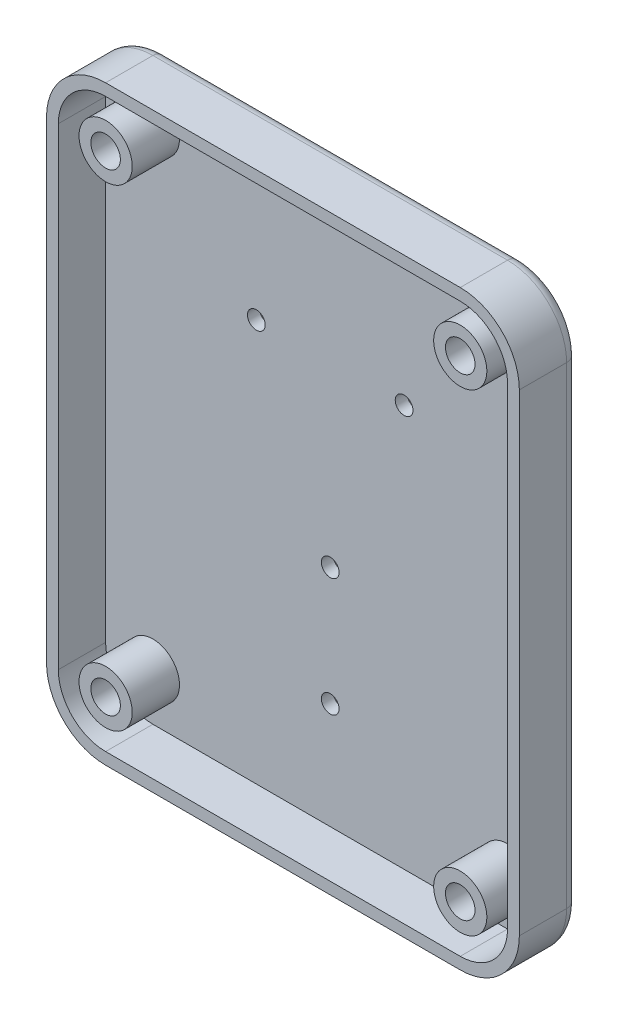
ISO-10303-21;
HEADER;
FILE_DESCRIPTION(('STEP AP214'),'2;1');
FILE_NAME('part.step','',(''),(''),'','','');
FILE_SCHEMA(('AUTOMOTIVE_DESIGN { 1 0 10303 214 1 1 1 1 }'));
ENDSEC;
DATA;
#1=APPLICATION_CONTEXT('core data for automotive mechanical design processes');
#2=APPLICATION_PROTOCOL_DEFINITION('international standard','automotive_design',2000,#1);
#3=PRODUCT_CONTEXT('',#1,'mechanical');
#4=PRODUCT('Part','Part','',(#3));
#5=PRODUCT_RELATED_PRODUCT_CATEGORY('part','',(#4));
#6=PRODUCT_DEFINITION_FORMATION('','',#4);
#7=PRODUCT_DEFINITION_CONTEXT('part definition',#1,'design');
#8=PRODUCT_DEFINITION('design','',#6,#7);
#9=PRODUCT_DEFINITION_SHAPE('','',#8);
#10=(LENGTH_UNIT() NAMED_UNIT(*) SI_UNIT(.MILLI.,.METRE.));
#11=(NAMED_UNIT(*) PLANE_ANGLE_UNIT() SI_UNIT($,.RADIAN.));
#12=(NAMED_UNIT(*) SI_UNIT($,.STERADIAN.) SOLID_ANGLE_UNIT());
#13=UNCERTAINTY_MEASURE_WITH_UNIT(LENGTH_MEASURE(1.E-05),#10,'distance_accuracy_value','');
#14=(GEOMETRIC_REPRESENTATION_CONTEXT(3) GLOBAL_UNCERTAINTY_ASSIGNED_CONTEXT((#13)) GLOBAL_UNIT_ASSIGNED_CONTEXT((#10,
#11,#12)) REPRESENTATION_CONTEXT('',''));
#15=CARTESIAN_POINT('',(0.,0.,0.));
#16=DIRECTION('',(0.,0.,1.));
#17=DIRECTION('',(1.,0.,0.));
#18=AXIS2_PLACEMENT_3D('',#15,#16,#17);
#19=CARTESIAN_POINT('',(0.,0.,10.));
#20=DIRECTION('',(0.,0.,-1.));
#21=DIRECTION('',(-1.,0.,0.));
#22=AXIS2_PLACEMENT_3D('',#19,#20,#21);
#23=PLANE('',#22);
#24=CARTESIAN_POINT('',(30.,40.,10.));
#25=DIRECTION('',(0.,0.,-1.));
#26=DIRECTION('',(-1.,0.,0.));
#27=AXIS2_PLACEMENT_3D('',#24,#25,#26);
#28=CIRCLE('',#27,4.5);
#29=CARTESIAN_POINT('',(25.5,40.,10.));
#30=VERTEX_POINT('',#29);
#31=EDGE_CURVE('E219',#30,#30,#28,.T.);
#32=ORIENTED_EDGE('',*,*,#31,.F.);
#33=EDGE_LOOP('',(#32));
#34=FACE_BOUND('',#33,.T.);
#35=CARTESIAN_POINT('',(30.,40.,10.));
#36=DIRECTION('',(0.,0.,-1.));
#37=DIRECTION('',(-1.,0.,0.));
#38=AXIS2_PLACEMENT_3D('',#35,#36,#37);
#39=CIRCLE('',#38,2.5);
#40=CARTESIAN_POINT('',(27.5,40.,10.));
#41=VERTEX_POINT('',#40);
#42=EDGE_CURVE('E275',#41,#41,#39,.T.);
#43=ORIENTED_EDGE('',*,*,#42,.T.);
#44=EDGE_LOOP('',(#43));
#45=FACE_BOUND('',#44,.T.);
#46=ADVANCED_FACE('F32',(#34,#45),#23,.F.);
#47=CARTESIAN_POINT('',(-30.,-40.,10.));
#48=DIRECTION('',(0.,0.,-1.));
#49=DIRECTION('',(-1.,0.,0.));
#50=AXIS2_PLACEMENT_3D('',#47,#48,#49);
#51=CIRCLE('',#50,4.5);
#52=CARTESIAN_POINT('',(-34.5,-40.,10.));
#53=VERTEX_POINT('',#52);
#54=EDGE_CURVE('E220',#53,#53,#51,.T.);
#55=ORIENTED_EDGE('',*,*,#54,.F.);
#56=EDGE_LOOP('',(#55));
#57=FACE_BOUND('',#56,.T.);
#58=CARTESIAN_POINT('',(-30.,-40.,10.));
#59=DIRECTION('',(0.,0.,-1.));
#60=DIRECTION('',(-1.,0.,0.));
#61=AXIS2_PLACEMENT_3D('',#58,#59,#60);
#62=CIRCLE('',#61,2.5);
#63=CARTESIAN_POINT('',(-32.5,-40.,10.));
#64=VERTEX_POINT('',#63);
#65=EDGE_CURVE('E282',#64,#64,#62,.T.);
#66=ORIENTED_EDGE('',*,*,#65,.T.);
#67=EDGE_LOOP('',(#66));
#68=FACE_BOUND('',#67,.T.);
#69=ADVANCED_FACE('F410',(#57,#68),#23,.F.);
#70=CARTESIAN_POINT('',(-30.,40.,10.));
#71=DIRECTION('',(0.,0.,-1.));
#72=DIRECTION('',(-1.,0.,0.));
#73=AXIS2_PLACEMENT_3D('',#70,#71,#72);
#74=CIRCLE('',#73,4.5);
#75=CARTESIAN_POINT('',(-34.5,40.,10.));
#76=VERTEX_POINT('',#75);
#77=EDGE_CURVE('E224',#76,#76,#74,.T.);
#78=ORIENTED_EDGE('',*,*,#77,.F.);
#79=EDGE_LOOP('',(#78));
#80=FACE_BOUND('',#79,.T.);
#81=CARTESIAN_POINT('',(-30.,40.,10.));
#82=DIRECTION('',(0.,0.,-1.));
#83=DIRECTION('',(-1.,0.,0.));
#84=AXIS2_PLACEMENT_3D('',#81,#82,#83);
#85=CIRCLE('',#84,2.5);
#86=CARTESIAN_POINT('',(-32.5,40.,10.));
#87=VERTEX_POINT('',#86);
#88=EDGE_CURVE('E267',#87,#87,#85,.T.);
#89=ORIENTED_EDGE('',*,*,#88,.T.);
#90=EDGE_LOOP('',(#89));
#91=FACE_BOUND('',#90,.T.);
#92=ADVANCED_FACE('F417',(#80,#91),#23,.F.);
#93=CARTESIAN_POINT('',(30.,-40.,10.));
#94=DIRECTION('',(0.,0.,-1.));
#95=DIRECTION('',(-1.,0.,0.));
#96=AXIS2_PLACEMENT_3D('',#93,#94,#95);
#97=CIRCLE('',#96,4.5);
#98=CARTESIAN_POINT('',(25.5,-40.,10.));
#99=VERTEX_POINT('',#98);
#100=EDGE_CURVE('E231',#99,#99,#97,.T.);
#101=ORIENTED_EDGE('',*,*,#100,.F.);
#102=EDGE_LOOP('',(#101));
#103=FACE_BOUND('',#102,.T.);
#104=CARTESIAN_POINT('',(30.,-40.,10.));
#105=DIRECTION('',(0.,0.,-1.));
#106=DIRECTION('',(-1.,0.,0.));
#107=AXIS2_PLACEMENT_3D('',#104,#105,#106);
#108=CIRCLE('',#107,2.5);
#109=CARTESIAN_POINT('',(27.5,-40.,10.));
#110=VERTEX_POINT('',#109);
#111=EDGE_CURVE('E287',#110,#110,#108,.T.);
#112=ORIENTED_EDGE('',*,*,#111,.T.);
#113=EDGE_LOOP('',(#112));
#114=FACE_BOUND('',#113,.T.);
#115=ADVANCED_FACE('F427',(#103,#114),#23,.F.);
#116=CARTESIAN_POINT('',(40.,-50.,10.));
#117=DIRECTION('',(-1.,0.,0.));
#118=DIRECTION('',(0.,0.,1.));
#119=AXIS2_PLACEMENT_3D('',#116,#117,#118);
#120=PLANE('',#119);
#121=DIRECTION('',(0.,0.,-1.));
#122=VECTOR('',#121,1.);
#123=CARTESIAN_POINT('',(40.,-40.,10.));
#124=LINE('',#123,#122);
#125=CARTESIAN_POINT('',(40.,-40.,10.));
#126=VERTEX_POINT('',#125);
#127=CARTESIAN_POINT('',(40.,-40.,2.));
#128=VERTEX_POINT('',#127);
#129=EDGE_CURVE('E306',#126,#128,#124,.T.);
#130=ORIENTED_EDGE('',*,*,#129,.T.);
#131=DIRECTION('',(0.,1.,0.));
#132=VECTOR('',#131,1.);
#133=CARTESIAN_POINT('',(40.,40.,2.));
#134=LINE('',#133,#132);
#135=CARTESIAN_POINT('',(40.,40.,2.));
#136=VERTEX_POINT('',#135);
#137=EDGE_CURVE('E359',#128,#136,#134,.T.);
#138=ORIENTED_EDGE('',*,*,#137,.T.);
#139=DIRECTION('',(0.,0.,-1.));
#140=VECTOR('',#139,1.);
#141=CARTESIAN_POINT('',(40.,40.,10.));
#142=LINE('',#141,#140);
#143=CARTESIAN_POINT('',(40.,40.,10.));
#144=VERTEX_POINT('',#143);
#145=EDGE_CURVE('E304',#136,#144,#142,.F.);
#146=ORIENTED_EDGE('',*,*,#145,.T.);
#147=DIRECTION('',(0.,1.,0.));
#148=VECTOR('',#147,1.);
#149=CARTESIAN_POINT('',(40.,-50.,10.));
#150=LINE('',#149,#148);
#151=EDGE_CURVE('E290',#126,#144,#150,.T.);
#152=ORIENTED_EDGE('',*,*,#151,.F.);
#153=EDGE_LOOP('',(#130,#138,#146,#152));
#154=FACE_BOUND('',#153,.T.);
#155=ADVANCED_FACE('F439',(#154),#120,.F.);
#156=CARTESIAN_POINT('',(-40.,50.,10.));
#157=DIRECTION('',(0.,-1.,0.));
#158=DIRECTION('',(0.,0.,-1.));
#159=AXIS2_PLACEMENT_3D('',#156,#157,#158);
#160=PLANE('',#159);
#161=DIRECTION('',(0.,0.,-1.));
#162=VECTOR('',#161,1.);
#163=CARTESIAN_POINT('',(30.,50.,10.));
#164=LINE('',#163,#162);
#165=CARTESIAN_POINT('',(30.,50.,10.));
#166=VERTEX_POINT('',#165);
#167=CARTESIAN_POINT('',(30.,50.,2.));
#168=VERTEX_POINT('',#167);
#169=EDGE_CURVE('E326',#166,#168,#164,.T.);
#170=ORIENTED_EDGE('',*,*,#169,.T.);
#171=DIRECTION('',(-1.,0.,0.));
#172=VECTOR('',#171,1.);
#173=CARTESIAN_POINT('',(-30.,50.,2.));
#174=LINE('',#173,#172);
#175=CARTESIAN_POINT('',(-30.,50.,2.));
#176=VERTEX_POINT('',#175);
#177=EDGE_CURVE('E355',#168,#176,#174,.T.);
#178=ORIENTED_EDGE('',*,*,#177,.T.);
#179=DIRECTION('',(0.,0.,-1.));
#180=VECTOR('',#179,1.);
#181=CARTESIAN_POINT('',(-30.,50.,10.));
#182=LINE('',#181,#180);
#183=CARTESIAN_POINT('',(-30.,50.,10.));
#184=VERTEX_POINT('',#183);
#185=EDGE_CURVE('E329',#176,#184,#182,.F.);
#186=ORIENTED_EDGE('',*,*,#185,.T.);
#187=DIRECTION('',(-1.,0.,0.));
#188=VECTOR('',#187,1.);
#189=CARTESIAN_POINT('',(-40.,50.,10.));
#190=LINE('',#189,#188);
#191=EDGE_CURVE('E295',#166,#184,#190,.T.);
#192=ORIENTED_EDGE('',*,*,#191,.F.);
#193=EDGE_LOOP('',(#170,#178,#186,#192));
#194=FACE_BOUND('',#193,.T.);
#195=ADVANCED_FACE('F445',(#194),#160,.F.);
#196=CARTESIAN_POINT('',(-40.,-50.,10.));
#197=DIRECTION('',(1.,0.,0.));
#198=DIRECTION('',(0.,0.,-1.));
#199=AXIS2_PLACEMENT_3D('',#196,#197,#198);
#200=PLANE('',#199);
#201=DIRECTION('',(0.,0.,-1.));
#202=VECTOR('',#201,1.);
#203=CARTESIAN_POINT('',(-40.,40.,10.));
#204=LINE('',#203,#202);
#205=CARTESIAN_POINT('',(-40.,40.,10.));
#206=VERTEX_POINT('',#205);
#207=CARTESIAN_POINT('',(-40.,40.,2.));
#208=VERTEX_POINT('',#207);
#209=EDGE_CURVE('E321',#206,#208,#204,.T.);
#210=ORIENTED_EDGE('',*,*,#209,.T.);
#211=DIRECTION('',(0.,-1.,0.));
#212=VECTOR('',#211,1.);
#213=CARTESIAN_POINT('',(-40.,-40.,2.));
#214=LINE('',#213,#212);
#215=CARTESIAN_POINT('',(-40.,-40.,2.));
#216=VERTEX_POINT('',#215);
#217=EDGE_CURVE('E351',#208,#216,#214,.T.);
#218=ORIENTED_EDGE('',*,*,#217,.T.);
#219=DIRECTION('',(0.,0.,-1.));
#220=VECTOR('',#219,1.);
#221=CARTESIAN_POINT('',(-40.,-40.,10.));
#222=LINE('',#221,#220);
#223=CARTESIAN_POINT('',(-40.,-40.,10.));
#224=VERTEX_POINT('',#223);
#225=EDGE_CURVE('E324',#216,#224,#222,.F.);
#226=ORIENTED_EDGE('',*,*,#225,.T.);
#227=DIRECTION('',(0.,-1.,0.));
#228=VECTOR('',#227,1.);
#229=CARTESIAN_POINT('',(-40.,-50.,10.));
#230=LINE('',#229,#228);
#231=EDGE_CURVE('E298',#206,#224,#230,.T.);
#232=ORIENTED_EDGE('',*,*,#231,.F.);
#233=EDGE_LOOP('',(#210,#218,#226,#232));
#234=FACE_BOUND('',#233,.T.);
#235=ADVANCED_FACE('F434',(#234),#200,.F.);
#236=CARTESIAN_POINT('',(-40.,-50.,10.));
#237=DIRECTION('',(0.,1.,0.));
#238=DIRECTION('',(0.,0.,1.));
#239=AXIS2_PLACEMENT_3D('',#236,#237,#238);
#240=PLANE('',#239);
#241=DIRECTION('',(0.,0.,-1.));
#242=VECTOR('',#241,1.);
#243=CARTESIAN_POINT('',(-30.,-50.,10.));
#244=LINE('',#243,#242);
#245=CARTESIAN_POINT('',(-30.,-50.,10.));
#246=VERTEX_POINT('',#245);
#247=CARTESIAN_POINT('',(-30.,-50.,2.));
#248=VERTEX_POINT('',#247);
#249=EDGE_CURVE('E309',#246,#248,#244,.T.);
#250=ORIENTED_EDGE('',*,*,#249,.T.);
#251=DIRECTION('',(1.,0.,0.));
#252=VECTOR('',#251,1.);
#253=CARTESIAN_POINT('',(30.,-50.,2.));
#254=LINE('',#253,#252);
#255=CARTESIAN_POINT('',(30.,-50.,2.));
#256=VERTEX_POINT('',#255);
#257=EDGE_CURVE('E11',#248,#256,#254,.T.);
#258=ORIENTED_EDGE('',*,*,#257,.T.);
#259=DIRECTION('',(0.,0.,-1.));
#260=VECTOR('',#259,1.);
#261=CARTESIAN_POINT('',(30.,-50.,10.));
#262=LINE('',#261,#260);
#263=CARTESIAN_POINT('',(30.,-50.,10.));
#264=VERTEX_POINT('',#263);
#265=EDGE_CURVE('E311',#256,#264,#262,.F.);
#266=ORIENTED_EDGE('',*,*,#265,.T.);
#267=DIRECTION('',(1.,0.,0.));
#268=VECTOR('',#267,1.);
#269=CARTESIAN_POINT('',(-40.,-50.,10.));
#270=LINE('',#269,#268);
#271=EDGE_CURVE('E301',#246,#264,#270,.T.);
#272=ORIENTED_EDGE('',*,*,#271,.F.);
#273=EDGE_LOOP('',(#250,#258,#266,#272));
#274=FACE_BOUND('',#273,.T.);
#275=ADVANCED_FACE('F425',(#274),#240,.F.);
#276=DIRECTION('',(1.,0.,0.));
#277=VECTOR('',#276,1.);
#278=CARTESIAN_POINT('',(0.,-48.,10.));
#279=LINE('',#278,#277);
#280=CARTESIAN_POINT('',(-30.,-48.,10.));
#281=VERTEX_POINT('',#280);
#282=CARTESIAN_POINT('',(30.,-48.,10.));
#283=VERTEX_POINT('',#282);
#284=EDGE_CURVE('E205',#281,#283,#279,.T.);
#285=ORIENTED_EDGE('',*,*,#284,.F.);
#286=CARTESIAN_POINT('',(-30.,-40.,10.));
#287=DIRECTION('',(0.,0.,-1.));
#288=DIRECTION('',(-1.,0.,0.));
#289=AXIS2_PLACEMENT_3D('',#286,#287,#288);
#290=CIRCLE('',#289,8.);
#291=CARTESIAN_POINT('',(-38.,-40.,10.));
#292=VERTEX_POINT('',#291);
#293=EDGE_CURVE('E253',#292,#281,#290,.F.);
#294=ORIENTED_EDGE('',*,*,#293,.F.);
#295=DIRECTION('',(0.,-1.,0.));
#296=VECTOR('',#295,1.);
#297=CARTESIAN_POINT('',(-38.,0.,10.));
#298=LINE('',#297,#296);
#299=CARTESIAN_POINT('',(-38.,40.,10.));
#300=VERTEX_POINT('',#299);
#301=EDGE_CURVE('E49',#300,#292,#298,.T.);
#302=ORIENTED_EDGE('',*,*,#301,.F.);
#303=CARTESIAN_POINT('',(-30.,40.,10.));
#304=DIRECTION('',(0.,0.,-1.));
#305=DIRECTION('',(-1.,0.,0.));
#306=AXIS2_PLACEMENT_3D('',#303,#304,#305);
#307=CIRCLE('',#306,8.);
#308=CARTESIAN_POINT('',(-30.,48.,10.));
#309=VERTEX_POINT('',#308);
#310=EDGE_CURVE('E249',#309,#300,#307,.F.);
#311=ORIENTED_EDGE('',*,*,#310,.F.);
#312=DIRECTION('',(-1.,0.,0.));
#313=VECTOR('',#312,1.);
#314=CARTESIAN_POINT('',(0.,48.,10.));
#315=LINE('',#314,#313);
#316=CARTESIAN_POINT('',(30.,48.,10.));
#317=VERTEX_POINT('',#316);
#318=EDGE_CURVE('E247',#317,#309,#315,.T.);
#319=ORIENTED_EDGE('',*,*,#318,.F.);
#320=CARTESIAN_POINT('',(30.,40.,10.));
#321=DIRECTION('',(0.,0.,-1.));
#322=DIRECTION('',(-1.,0.,0.));
#323=AXIS2_PLACEMENT_3D('',#320,#321,#322);
#324=CIRCLE('',#323,8.);
#325=CARTESIAN_POINT('',(38.,40.,10.));
#326=VERTEX_POINT('',#325);
#327=EDGE_CURVE('E244',#326,#317,#324,.F.);
#328=ORIENTED_EDGE('',*,*,#327,.F.);
#329=DIRECTION('',(0.,1.,0.));
#330=VECTOR('',#329,1.);
#331=CARTESIAN_POINT('',(38.,0.,10.));
#332=LINE('',#331,#330);
#333=CARTESIAN_POINT('',(38.,-40.,10.));
#334=VERTEX_POINT('',#333);
#335=EDGE_CURVE('E245',#334,#326,#332,.T.);
#336=ORIENTED_EDGE('',*,*,#335,.F.);
#337=CARTESIAN_POINT('',(30.,-40.,10.));
#338=DIRECTION('',(0.,0.,-1.));
#339=DIRECTION('',(-1.,0.,0.));
#340=AXIS2_PLACEMENT_3D('',#337,#338,#339);
#341=CIRCLE('',#340,8.);
#342=EDGE_CURVE('E177',#283,#334,#341,.F.);
#343=ORIENTED_EDGE('',*,*,#342,.F.);
#344=EDGE_LOOP('',(#285,#294,#302,#311,#319,#328,#336,#343));
#345=FACE_BOUND('',#344,.T.);
#346=ORIENTED_EDGE('',*,*,#271,.T.);
#347=CARTESIAN_POINT('',(30.,-40.,10.));
#348=DIRECTION('',(0.,0.,-1.));
#349=DIRECTION('',(-1.,0.,0.));
#350=AXIS2_PLACEMENT_3D('',#347,#348,#349);
#351=CIRCLE('',#350,10.);
#352=EDGE_CURVE('E319',#264,#126,#351,.F.);
#353=ORIENTED_EDGE('',*,*,#352,.T.);
#354=ORIENTED_EDGE('',*,*,#151,.T.);
#355=CARTESIAN_POINT('',(30.,40.,10.));
#356=DIRECTION('',(0.,0.,-1.));
#357=DIRECTION('',(-1.,0.,0.));
#358=AXIS2_PLACEMENT_3D('',#355,#356,#357);
#359=CIRCLE('',#358,10.);
#360=EDGE_CURVE('E313',#144,#166,#359,.F.);
#361=ORIENTED_EDGE('',*,*,#360,.T.);
#362=ORIENTED_EDGE('',*,*,#191,.T.);
#363=CARTESIAN_POINT('',(-30.,40.,10.));
#364=DIRECTION('',(0.,0.,-1.));
#365=DIRECTION('',(-1.,0.,0.));
#366=AXIS2_PLACEMENT_3D('',#363,#364,#365);
#367=CIRCLE('',#366,10.);
#368=EDGE_CURVE('E315',#184,#206,#367,.F.);
#369=ORIENTED_EDGE('',*,*,#368,.T.);
#370=ORIENTED_EDGE('',*,*,#231,.T.);
#371=CARTESIAN_POINT('',(-30.,-40.,10.));
#372=DIRECTION('',(0.,0.,-1.));
#373=DIRECTION('',(-1.,0.,0.));
#374=AXIS2_PLACEMENT_3D('',#371,#372,#373);
#375=CIRCLE('',#374,10.);
#376=EDGE_CURVE('E317',#224,#246,#375,.F.);
#377=ORIENTED_EDGE('',*,*,#376,.T.);
#378=EDGE_LOOP('',(#346,#353,#354,#361,#362,#369,#370,#377));
#379=FACE_BOUND('',#378,.T.);
#380=ADVANCED_FACE('F413',(#345,#379),#23,.F.);
#381=CARTESIAN_POINT('',(0.,0.,0.));
#382=DIRECTION('',(0.,0.,-1.));
#383=DIRECTION('',(-1.,0.,0.));
#384=AXIS2_PLACEMENT_3D('',#381,#382,#383);
#385=PLANE('',#384);
#386=CARTESIAN_POINT('',(-12.5,20.,0.));
#387=DIRECTION('',(0.,0.,-1.));
#388=DIRECTION('',(-1.,0.,0.));
#389=AXIS2_PLACEMENT_3D('',#386,#387,#388);
#390=CIRCLE('',#389,1.5);
#391=CARTESIAN_POINT('',(-14.,20.,0.));
#392=VERTEX_POINT('',#391);
#393=EDGE_CURVE('E542',#392,#392,#390,.T.);
#394=ORIENTED_EDGE('',*,*,#393,.F.);
#395=EDGE_LOOP('',(#394));
#396=FACE_BOUND('',#395,.T.);
#397=CARTESIAN_POINT('',(12.5,20.,0.));
#398=DIRECTION('',(0.,0.,-1.));
#399=DIRECTION('',(-1.,0.,0.));
#400=AXIS2_PLACEMENT_3D('',#397,#398,#399);
#401=CIRCLE('',#400,1.5);
#402=CARTESIAN_POINT('',(11.,20.,0.));
#403=VERTEX_POINT('',#402);
#404=EDGE_CURVE('E539',#403,#403,#401,.T.);
#405=ORIENTED_EDGE('',*,*,#404,.F.);
#406=EDGE_LOOP('',(#405));
#407=FACE_BOUND('',#406,.T.);
#408=CARTESIAN_POINT('',(0.,-30.,0.));
#409=DIRECTION('',(0.,0.,-1.));
#410=DIRECTION('',(-1.,0.,0.));
#411=AXIS2_PLACEMENT_3D('',#408,#409,#410);
#412=CIRCLE('',#411,1.5);
#413=CARTESIAN_POINT('',(-1.5,-30.,0.));
#414=VERTEX_POINT('',#413);
#415=EDGE_CURVE('E537',#414,#414,#412,.T.);
#416=ORIENTED_EDGE('',*,*,#415,.F.);
#417=EDGE_LOOP('',(#416));
#418=FACE_BOUND('',#417,.T.);
#419=CARTESIAN_POINT('',(0.,-10.,0.));
#420=DIRECTION('',(0.,0.,-1.));
#421=DIRECTION('',(-1.,0.,0.));
#422=AXIS2_PLACEMENT_3D('',#419,#420,#421);
#423=CIRCLE('',#422,1.5);
#424=CARTESIAN_POINT('',(-1.5,-10.,0.));
#425=VERTEX_POINT('',#424);
#426=EDGE_CURVE('E386',#425,#425,#423,.T.);
#427=ORIENTED_EDGE('',*,*,#426,.F.);
#428=EDGE_LOOP('',(#427));
#429=FACE_BOUND('',#428,.T.);
#430=DIRECTION('',(1.,0.,0.));
#431=VECTOR('',#430,1.);
#432=CARTESIAN_POINT('',(-30.,-48.,0.));
#433=LINE('',#432,#431);
#434=CARTESIAN_POINT('',(30.,-48.,0.));
#435=VERTEX_POINT('',#434);
#436=CARTESIAN_POINT('',(-30.,-48.,0.));
#437=VERTEX_POINT('',#436);
#438=EDGE_CURVE('E331',#435,#437,#433,.F.);
#439=ORIENTED_EDGE('',*,*,#438,.T.);
#440=CARTESIAN_POINT('',(-30.,-40.,0.));
#441=DIRECTION('',(0.,0.,-1.));
#442=DIRECTION('',(-1.,0.,0.));
#443=AXIS2_PLACEMENT_3D('',#440,#441,#442);
#444=CIRCLE('',#443,8.);
#445=CARTESIAN_POINT('',(-38.,-40.,0.));
#446=VERTEX_POINT('',#445);
#447=EDGE_CURVE('E345',#437,#446,#444,.T.);
#448=ORIENTED_EDGE('',*,*,#447,.T.);
#449=DIRECTION('',(0.,-1.,0.));
#450=VECTOR('',#449,1.);
#451=CARTESIAN_POINT('',(-38.,40.,0.));
#452=LINE('',#451,#450);
#453=CARTESIAN_POINT('',(-38.,40.,0.));
#454=VERTEX_POINT('',#453);
#455=EDGE_CURVE('E343',#446,#454,#452,.F.);
#456=ORIENTED_EDGE('',*,*,#455,.T.);
#457=CARTESIAN_POINT('',(-30.,40.,0.));
#458=DIRECTION('',(0.,0.,-1.));
#459=DIRECTION('',(-1.,0.,0.));
#460=AXIS2_PLACEMENT_3D('',#457,#458,#459);
#461=CIRCLE('',#460,8.);
#462=CARTESIAN_POINT('',(-30.,48.,0.));
#463=VERTEX_POINT('',#462);
#464=EDGE_CURVE('E341',#454,#463,#461,.T.);
#465=ORIENTED_EDGE('',*,*,#464,.T.);
#466=DIRECTION('',(-1.,0.,0.));
#467=VECTOR('',#466,1.);
#468=CARTESIAN_POINT('',(30.,48.,0.));
#469=LINE('',#468,#467);
#470=CARTESIAN_POINT('',(30.,48.,0.));
#471=VERTEX_POINT('',#470);
#472=EDGE_CURVE('E339',#463,#471,#469,.F.);
#473=ORIENTED_EDGE('',*,*,#472,.T.);
#474=CARTESIAN_POINT('',(30.,40.,0.));
#475=DIRECTION('',(0.,0.,-1.));
#476=DIRECTION('',(-1.,0.,0.));
#477=AXIS2_PLACEMENT_3D('',#474,#475,#476);
#478=CIRCLE('',#477,8.);
#479=CARTESIAN_POINT('',(38.,40.,0.));
#480=VERTEX_POINT('',#479);
#481=EDGE_CURVE('E337',#471,#480,#478,.T.);
#482=ORIENTED_EDGE('',*,*,#481,.T.);
#483=DIRECTION('',(0.,1.,0.));
#484=VECTOR('',#483,1.);
#485=CARTESIAN_POINT('',(38.,-40.,0.));
#486=LINE('',#485,#484);
#487=CARTESIAN_POINT('',(38.,-40.,0.));
#488=VERTEX_POINT('',#487);
#489=EDGE_CURVE('E335',#480,#488,#486,.F.);
#490=ORIENTED_EDGE('',*,*,#489,.T.);
#491=CARTESIAN_POINT('',(30.,-40.,0.));
#492=DIRECTION('',(0.,0.,-1.));
#493=DIRECTION('',(-1.,0.,0.));
#494=AXIS2_PLACEMENT_3D('',#491,#492,#493);
#495=CIRCLE('',#494,8.);
#496=EDGE_CURVE('E333',#488,#435,#495,.T.);
#497=ORIENTED_EDGE('',*,*,#496,.T.);
#498=EDGE_LOOP('',(#439,#448,#456,#465,#473,#482,#490,#497));
#499=FACE_BOUND('',#498,.T.);
#500=CARTESIAN_POINT('',(30.,40.,0.));
#501=DIRECTION('',(0.,0.,-1.));
#502=DIRECTION('',(-1.,0.,0.));
#503=AXIS2_PLACEMENT_3D('',#500,#501,#502);
#504=CIRCLE('',#503,2.5);
#505=CARTESIAN_POINT('',(27.5,40.,0.));
#506=VERTEX_POINT('',#505);
#507=EDGE_CURVE('E279',#506,#506,#504,.T.);
#508=ORIENTED_EDGE('',*,*,#507,.F.);
#509=EDGE_LOOP('',(#508));
#510=FACE_BOUND('',#509,.T.);
#511=CARTESIAN_POINT('',(-30.,-40.,0.));
#512=DIRECTION('',(0.,0.,-1.));
#513=DIRECTION('',(-1.,0.,0.));
#514=AXIS2_PLACEMENT_3D('',#511,#512,#513);
#515=CIRCLE('',#514,2.5);
#516=CARTESIAN_POINT('',(-32.5,-40.,0.));
#517=VERTEX_POINT('',#516);
#518=EDGE_CURVE('E270',#517,#517,#515,.T.);
#519=ORIENTED_EDGE('',*,*,#518,.F.);
#520=EDGE_LOOP('',(#519));
#521=FACE_BOUND('',#520,.T.);
#522=CARTESIAN_POINT('',(-30.,40.,0.));
#523=DIRECTION('',(0.,0.,-1.));
#524=DIRECTION('',(-1.,0.,0.));
#525=AXIS2_PLACEMENT_3D('',#522,#523,#524);
#526=CIRCLE('',#525,2.5);
#527=CARTESIAN_POINT('',(-32.5,40.,0.));
#528=VERTEX_POINT('',#527);
#529=EDGE_CURVE('E271',#528,#528,#526,.T.);
#530=ORIENTED_EDGE('',*,*,#529,.F.);
#531=EDGE_LOOP('',(#530));
#532=FACE_BOUND('',#531,.T.);
#533=CARTESIAN_POINT('',(30.,-40.,0.));
#534=DIRECTION('',(0.,0.,-1.));
#535=DIRECTION('',(-1.,0.,0.));
#536=AXIS2_PLACEMENT_3D('',#533,#534,#535);
#537=CIRCLE('',#536,2.5);
#538=CARTESIAN_POINT('',(27.5,-40.,0.));
#539=VERTEX_POINT('',#538);
#540=EDGE_CURVE('E278',#539,#539,#537,.T.);
#541=ORIENTED_EDGE('',*,*,#540,.F.);
#542=EDGE_LOOP('',(#541));
#543=FACE_BOUND('',#542,.T.);
#544=ADVANCED_FACE('F424',(#396,#407,#418,#429,#499,#510,#521,#532,#543),#385,.T.);
#545=CARTESIAN_POINT('',(30.,-40.,10.));
#546=DIRECTION('',(0.,0.,-1.));
#547=DIRECTION('',(-1.,0.,0.));
#548=AXIS2_PLACEMENT_3D('',#545,#546,#547);
#549=CYLINDRICAL_SURFACE('',#548,10.);
#550=ORIENTED_EDGE('',*,*,#265,.F.);
#551=CARTESIAN_POINT('',(30.,-40.,2.));
#552=DIRECTION('',(0.,0.,-1.));
#553=DIRECTION('',(-1.,0.,0.));
#554=AXIS2_PLACEMENT_3D('',#551,#552,#553);
#555=CIRCLE('',#554,10.);
#556=EDGE_CURVE('E41',#256,#128,#555,.F.);
#557=ORIENTED_EDGE('',*,*,#556,.T.);
#558=ORIENTED_EDGE('',*,*,#129,.F.);
#559=ORIENTED_EDGE('',*,*,#352,.F.);
#560=EDGE_LOOP('',(#550,#557,#558,#559));
#561=FACE_BOUND('',#560,.T.);
#562=ADVANCED_FACE('F432',(#561),#549,.T.);
#563=CARTESIAN_POINT('',(-30.,-40.,10.));
#564=DIRECTION('',(0.,0.,-1.));
#565=DIRECTION('',(-1.,0.,0.));
#566=AXIS2_PLACEMENT_3D('',#563,#564,#565);
#567=CYLINDRICAL_SURFACE('',#566,10.);
#568=ORIENTED_EDGE('',*,*,#225,.F.);
#569=CARTESIAN_POINT('',(-30.,-40.,2.));
#570=DIRECTION('',(0.,0.,-1.));
#571=DIRECTION('',(-1.,0.,0.));
#572=AXIS2_PLACEMENT_3D('',#569,#570,#571);
#573=CIRCLE('',#572,10.);
#574=EDGE_CURVE('E348',#216,#248,#573,.F.);
#575=ORIENTED_EDGE('',*,*,#574,.T.);
#576=ORIENTED_EDGE('',*,*,#249,.F.);
#577=ORIENTED_EDGE('',*,*,#376,.F.);
#578=EDGE_LOOP('',(#568,#575,#576,#577));
#579=FACE_BOUND('',#578,.T.);
#580=ADVANCED_FACE('F617',(#579),#567,.T.);
#581=CARTESIAN_POINT('',(-30.,40.,10.));
#582=DIRECTION('',(0.,0.,-1.));
#583=DIRECTION('',(-1.,0.,0.));
#584=AXIS2_PLACEMENT_3D('',#581,#582,#583);
#585=CYLINDRICAL_SURFACE('',#584,10.);
#586=ORIENTED_EDGE('',*,*,#185,.F.);
#587=CARTESIAN_POINT('',(-30.,40.,2.));
#588=DIRECTION('',(0.,0.,-1.));
#589=DIRECTION('',(-1.,0.,0.));
#590=AXIS2_PLACEMENT_3D('',#587,#588,#589);
#591=CIRCLE('',#590,10.);
#592=EDGE_CURVE('E353',#176,#208,#591,.F.);
#593=ORIENTED_EDGE('',*,*,#592,.T.);
#594=ORIENTED_EDGE('',*,*,#209,.F.);
#595=ORIENTED_EDGE('',*,*,#368,.F.);
#596=EDGE_LOOP('',(#586,#593,#594,#595));
#597=FACE_BOUND('',#596,.T.);
#598=ADVANCED_FACE('F467',(#597),#585,.T.);
#599=CARTESIAN_POINT('',(30.,40.,10.));
#600=DIRECTION('',(0.,0.,-1.));
#601=DIRECTION('',(-1.,0.,0.));
#602=AXIS2_PLACEMENT_3D('',#599,#600,#601);
#603=CYLINDRICAL_SURFACE('',#602,10.);
#604=ORIENTED_EDGE('',*,*,#145,.F.);
#605=CARTESIAN_POINT('',(30.,40.,2.));
#606=DIRECTION('',(0.,0.,-1.));
#607=DIRECTION('',(-1.,0.,0.));
#608=AXIS2_PLACEMENT_3D('',#605,#606,#607);
#609=CIRCLE('',#608,10.);
#610=EDGE_CURVE('E357',#136,#168,#609,.F.);
#611=ORIENTED_EDGE('',*,*,#610,.T.);
#612=ORIENTED_EDGE('',*,*,#169,.F.);
#613=ORIENTED_EDGE('',*,*,#360,.F.);
#614=EDGE_LOOP('',(#604,#611,#612,#613));
#615=FACE_BOUND('',#614,.T.);
#616=ADVANCED_FACE('F457',(#615),#603,.T.);
#617=CARTESIAN_POINT('',(30.,-40.,10.));
#618=DIRECTION('',(0.,0.,-1.));
#619=DIRECTION('',(-1.,0.,0.));
#620=AXIS2_PLACEMENT_3D('',#617,#618,#619);
#621=CYLINDRICAL_SURFACE('',#620,2.5);
#622=ORIENTED_EDGE('',*,*,#111,.F.);
#623=EDGE_LOOP('',(#622));
#624=FACE_BOUND('',#623,.T.);
#625=ORIENTED_EDGE('',*,*,#540,.T.);
#626=EDGE_LOOP('',(#625));
#627=FACE_BOUND('',#626,.T.);
#628=ADVANCED_FACE('F453',(#624,#627),#621,.F.);
#629=CARTESIAN_POINT('',(-30.,40.,10.));
#630=DIRECTION('',(0.,0.,-1.));
#631=DIRECTION('',(-1.,0.,0.));
#632=AXIS2_PLACEMENT_3D('',#629,#630,#631);
#633=CYLINDRICAL_SURFACE('',#632,2.5);
#634=ORIENTED_EDGE('',*,*,#88,.F.);
#635=EDGE_LOOP('',(#634));
#636=FACE_BOUND('',#635,.T.);
#637=ORIENTED_EDGE('',*,*,#529,.T.);
#638=EDGE_LOOP('',(#637));
#639=FACE_BOUND('',#638,.T.);
#640=ADVANCED_FACE('F456',(#636,#639),#633,.F.);
#641=CARTESIAN_POINT('',(-30.,-40.,10.));
#642=DIRECTION('',(0.,0.,-1.));
#643=DIRECTION('',(-1.,0.,0.));
#644=AXIS2_PLACEMENT_3D('',#641,#642,#643);
#645=CYLINDRICAL_SURFACE('',#644,2.5);
#646=ORIENTED_EDGE('',*,*,#65,.F.);
#647=EDGE_LOOP('',(#646));
#648=FACE_BOUND('',#647,.T.);
#649=ORIENTED_EDGE('',*,*,#518,.T.);
#650=EDGE_LOOP('',(#649));
#651=FACE_BOUND('',#650,.T.);
#652=ADVANCED_FACE('F464',(#648,#651),#645,.F.);
#653=CARTESIAN_POINT('',(30.,40.,10.));
#654=DIRECTION('',(0.,0.,-1.));
#655=DIRECTION('',(-1.,0.,0.));
#656=AXIS2_PLACEMENT_3D('',#653,#654,#655);
#657=CYLINDRICAL_SURFACE('',#656,2.5);
#658=ORIENTED_EDGE('',*,*,#42,.F.);
#659=EDGE_LOOP('',(#658));
#660=FACE_BOUND('',#659,.T.);
#661=ORIENTED_EDGE('',*,*,#507,.T.);
#662=EDGE_LOOP('',(#661));
#663=FACE_BOUND('',#662,.T.);
#664=ADVANCED_FACE('F473',(#660,#663),#657,.F.);
#665=CARTESIAN_POINT('',(30.,40.,2.));
#666=DIRECTION('',(0.,0.,-1.));
#667=DIRECTION('',(-1.,0.,0.));
#668=AXIS2_PLACEMENT_3D('',#665,#666,#667);
#669=TOROIDAL_SURFACE('',#668,8.,2.);
#670=CARTESIAN_POINT('',(30.,48.,2.));
#671=DIRECTION('',(-1.,0.,0.));
#672=DIRECTION('',(0.,0.,1.));
#673=AXIS2_PLACEMENT_3D('',#670,#671,#672);
#674=CIRCLE('',#673,2.);
#675=EDGE_CURVE('E377',#168,#471,#674,.T.);
#676=ORIENTED_EDGE('',*,*,#675,.F.);
#677=ORIENTED_EDGE('',*,*,#610,.F.);
#678=CARTESIAN_POINT('',(38.,40.,2.));
#679=DIRECTION('',(0.,-1.,0.));
#680=DIRECTION('',(0.,0.,-1.));
#681=AXIS2_PLACEMENT_3D('',#678,#679,#680);
#682=CIRCLE('',#681,2.);
#683=EDGE_CURVE('E274',#480,#136,#682,.T.);
#684=ORIENTED_EDGE('',*,*,#683,.F.);
#685=ORIENTED_EDGE('',*,*,#481,.F.);
#686=EDGE_LOOP('',(#676,#677,#684,#685));
#687=FACE_BOUND('',#686,.T.);
#688=ADVANCED_FACE('F34',(#687),#669,.T.);
#689=CARTESIAN_POINT('',(38.,-50.,2.));
#690=DIRECTION('',(0.,-1.,0.));
#691=DIRECTION('',(0.,0.,-1.));
#692=AXIS2_PLACEMENT_3D('',#689,#690,#691);
#693=CYLINDRICAL_SURFACE('',#692,2.);
#694=ORIENTED_EDGE('',*,*,#683,.T.);
#695=ORIENTED_EDGE('',*,*,#137,.F.);
#696=CARTESIAN_POINT('',(38.,-40.,2.));
#697=DIRECTION('',(0.,-1.,0.));
#698=DIRECTION('',(0.,0.,-1.));
#699=AXIS2_PLACEMENT_3D('',#696,#697,#698);
#700=CIRCLE('',#699,2.);
#701=EDGE_CURVE('E374',#488,#128,#700,.T.);
#702=ORIENTED_EDGE('',*,*,#701,.F.);
#703=ORIENTED_EDGE('',*,*,#489,.F.);
#704=EDGE_LOOP('',(#694,#695,#702,#703));
#705=FACE_BOUND('',#704,.T.);
#706=ADVANCED_FACE('F593',(#705),#693,.T.);
#707=CARTESIAN_POINT('',(-40.,48.,2.));
#708=DIRECTION('',(1.,0.,0.));
#709=DIRECTION('',(0.,0.,-1.));
#710=AXIS2_PLACEMENT_3D('',#707,#708,#709);
#711=CYLINDRICAL_SURFACE('',#710,2.);
#712=ORIENTED_EDGE('',*,*,#675,.T.);
#713=ORIENTED_EDGE('',*,*,#472,.F.);
#714=CARTESIAN_POINT('',(-30.,48.,2.));
#715=DIRECTION('',(-1.,0.,0.));
#716=DIRECTION('',(0.,0.,1.));
#717=AXIS2_PLACEMENT_3D('',#714,#715,#716);
#718=CIRCLE('',#717,2.);
#719=EDGE_CURVE('E371',#176,#463,#718,.T.);
#720=ORIENTED_EDGE('',*,*,#719,.F.);
#721=ORIENTED_EDGE('',*,*,#177,.F.);
#722=EDGE_LOOP('',(#712,#713,#720,#721));
#723=FACE_BOUND('',#722,.T.);
#724=ADVANCED_FACE('F583',(#723),#711,.T.);
#725=CARTESIAN_POINT('',(30.,-40.,2.));
#726=DIRECTION('',(0.,0.,-1.));
#727=DIRECTION('',(-1.,0.,0.));
#728=AXIS2_PLACEMENT_3D('',#725,#726,#727);
#729=TOROIDAL_SURFACE('',#728,8.,2.);
#730=ORIENTED_EDGE('',*,*,#701,.T.);
#731=ORIENTED_EDGE('',*,*,#556,.F.);
#732=CARTESIAN_POINT('',(30.,-48.,2.));
#733=DIRECTION('',(-1.,0.,0.));
#734=DIRECTION('',(0.,0.,1.));
#735=AXIS2_PLACEMENT_3D('',#732,#733,#734);
#736=CIRCLE('',#735,2.);
#737=EDGE_CURVE('E368',#435,#256,#736,.T.);
#738=ORIENTED_EDGE('',*,*,#737,.F.);
#739=ORIENTED_EDGE('',*,*,#496,.F.);
#740=EDGE_LOOP('',(#730,#731,#738,#739));
#741=FACE_BOUND('',#740,.T.);
#742=ADVANCED_FACE('F596',(#741),#729,.T.);
#743=CARTESIAN_POINT('',(-30.,40.,2.));
#744=DIRECTION('',(0.,0.,-1.));
#745=DIRECTION('',(-1.,0.,0.));
#746=AXIS2_PLACEMENT_3D('',#743,#744,#745);
#747=TOROIDAL_SURFACE('',#746,8.,2.);
#748=ORIENTED_EDGE('',*,*,#719,.T.);
#749=ORIENTED_EDGE('',*,*,#464,.F.);
#750=CARTESIAN_POINT('',(-38.,40.,2.));
#751=DIRECTION('',(0.,-1.,0.));
#752=DIRECTION('',(0.,0.,-1.));
#753=AXIS2_PLACEMENT_3D('',#750,#751,#752);
#754=CIRCLE('',#753,2.);
#755=EDGE_CURVE('E365',#208,#454,#754,.T.);
#756=ORIENTED_EDGE('',*,*,#755,.F.);
#757=ORIENTED_EDGE('',*,*,#592,.F.);
#758=EDGE_LOOP('',(#748,#749,#756,#757));
#759=FACE_BOUND('',#758,.T.);
#760=ADVANCED_FACE('F578',(#759),#747,.T.);
#761=CARTESIAN_POINT('',(-40.,-48.,2.));
#762=DIRECTION('',(-1.,0.,0.));
#763=DIRECTION('',(0.,0.,1.));
#764=AXIS2_PLACEMENT_3D('',#761,#762,#763);
#765=CYLINDRICAL_SURFACE('',#764,2.);
#766=ORIENTED_EDGE('',*,*,#737,.T.);
#767=ORIENTED_EDGE('',*,*,#257,.F.);
#768=CARTESIAN_POINT('',(-30.,-48.,2.));
#769=DIRECTION('',(-1.,0.,0.));
#770=DIRECTION('',(0.,0.,1.));
#771=AXIS2_PLACEMENT_3D('',#768,#769,#770);
#772=CIRCLE('',#771,2.);
#773=EDGE_CURVE('E363',#437,#248,#772,.T.);
#774=ORIENTED_EDGE('',*,*,#773,.F.);
#775=ORIENTED_EDGE('',*,*,#438,.F.);
#776=EDGE_LOOP('',(#766,#767,#774,#775));
#777=FACE_BOUND('',#776,.T.);
#778=ADVANCED_FACE('F566',(#777),#765,.T.);
#779=CARTESIAN_POINT('',(-38.,-50.,2.));
#780=DIRECTION('',(0.,1.,0.));
#781=DIRECTION('',(0.,0.,1.));
#782=AXIS2_PLACEMENT_3D('',#779,#780,#781);
#783=CYLINDRICAL_SURFACE('',#782,2.);
#784=ORIENTED_EDGE('',*,*,#755,.T.);
#785=ORIENTED_EDGE('',*,*,#455,.F.);
#786=CARTESIAN_POINT('',(-38.,-40.,2.));
#787=DIRECTION('',(0.,-1.,0.));
#788=DIRECTION('',(0.,0.,-1.));
#789=AXIS2_PLACEMENT_3D('',#786,#787,#788);
#790=CIRCLE('',#789,2.);
#791=EDGE_CURVE('E207',#216,#446,#790,.T.);
#792=ORIENTED_EDGE('',*,*,#791,.F.);
#793=ORIENTED_EDGE('',*,*,#217,.F.);
#794=EDGE_LOOP('',(#784,#785,#792,#793));
#795=FACE_BOUND('',#794,.T.);
#796=ADVANCED_FACE('F573',(#795),#783,.T.);
#797=CARTESIAN_POINT('',(-30.,-40.,2.));
#798=DIRECTION('',(0.,0.,-1.));
#799=DIRECTION('',(-1.,0.,0.));
#800=AXIS2_PLACEMENT_3D('',#797,#798,#799);
#801=TOROIDAL_SURFACE('',#800,8.,2.);
#802=ORIENTED_EDGE('',*,*,#773,.T.);
#803=ORIENTED_EDGE('',*,*,#574,.F.);
#804=ORIENTED_EDGE('',*,*,#791,.T.);
#805=ORIENTED_EDGE('',*,*,#447,.F.);
#806=EDGE_LOOP('',(#802,#803,#804,#805));
#807=FACE_BOUND('',#806,.T.);
#808=ADVANCED_FACE('F523',(#807),#801,.T.);
#809=CARTESIAN_POINT('',(38.,-50.,10.));
#810=DIRECTION('',(-1.,0.,0.));
#811=DIRECTION('',(0.,0.,1.));
#812=AXIS2_PLACEMENT_3D('',#809,#810,#811);
#813=PLANE('',#812);
#814=DIRECTION('',(0.,0.,1.));
#815=VECTOR('',#814,1.);
#816=CARTESIAN_POINT('',(38.,-40.,10.));
#817=LINE('',#816,#815);
#818=CARTESIAN_POINT('',(38.,-40.,2.));
#819=VERTEX_POINT('',#818);
#820=EDGE_CURVE('E172',#334,#819,#817,.F.);
#821=ORIENTED_EDGE('',*,*,#820,.F.);
#822=ORIENTED_EDGE('',*,*,#335,.T.);
#823=DIRECTION('',(0.,0.,1.));
#824=VECTOR('',#823,1.);
#825=CARTESIAN_POINT('',(38.,40.,10.));
#826=LINE('',#825,#824);
#827=CARTESIAN_POINT('',(38.,40.,2.));
#828=VERTEX_POINT('',#827);
#829=EDGE_CURVE('E183',#828,#326,#826,.T.);
#830=ORIENTED_EDGE('',*,*,#829,.F.);
#831=DIRECTION('',(0.,1.,0.));
#832=VECTOR('',#831,1.);
#833=CARTESIAN_POINT('',(38.,0.,2.));
#834=LINE('',#833,#832);
#835=EDGE_CURVE('E191',#819,#828,#834,.T.);
#836=ORIENTED_EDGE('',*,*,#835,.F.);
#837=EDGE_LOOP('',(#821,#822,#830,#836));
#838=FACE_BOUND('',#837,.T.);
#839=ADVANCED_FACE('F197',(#838),#813,.T.);
#840=CARTESIAN_POINT('',(-40.,48.,10.));
#841=DIRECTION('',(0.,-1.,0.));
#842=DIRECTION('',(0.,0.,-1.));
#843=AXIS2_PLACEMENT_3D('',#840,#841,#842);
#844=PLANE('',#843);
#845=DIRECTION('',(0.,0.,-1.));
#846=VECTOR('',#845,1.);
#847=CARTESIAN_POINT('',(30.,48.,10.));
#848=LINE('',#847,#846);
#849=CARTESIAN_POINT('',(30.,48.,2.));
#850=VERTEX_POINT('',#849);
#851=EDGE_CURVE('E232',#317,#850,#848,.T.);
#852=ORIENTED_EDGE('',*,*,#851,.F.);
#853=ORIENTED_EDGE('',*,*,#318,.T.);
#854=DIRECTION('',(0.,0.,-1.));
#855=VECTOR('',#854,1.);
#856=CARTESIAN_POINT('',(-30.,48.,10.));
#857=LINE('',#856,#855);
#858=CARTESIAN_POINT('',(-30.,48.,2.));
#859=VERTEX_POINT('',#858);
#860=EDGE_CURVE('E214',#859,#309,#857,.F.);
#861=ORIENTED_EDGE('',*,*,#860,.F.);
#862=DIRECTION('',(1.,0.,0.));
#863=VECTOR('',#862,1.);
#864=CARTESIAN_POINT('',(-40.,48.,2.));
#865=LINE('',#864,#863);
#866=EDGE_CURVE('E213',#859,#850,#865,.T.);
#867=ORIENTED_EDGE('',*,*,#866,.T.);
#868=EDGE_LOOP('',(#852,#853,#861,#867));
#869=FACE_BOUND('',#868,.T.);
#870=ADVANCED_FACE('F518',(#869),#844,.T.);
#871=CARTESIAN_POINT('',(-38.,-50.,10.));
#872=DIRECTION('',(1.,0.,0.));
#873=DIRECTION('',(0.,0.,-1.));
#874=AXIS2_PLACEMENT_3D('',#871,#872,#873);
#875=PLANE('',#874);
#876=DIRECTION('',(0.,0.,-1.));
#877=VECTOR('',#876,1.);
#878=CARTESIAN_POINT('',(-38.,40.,10.));
#879=LINE('',#878,#877);
#880=CARTESIAN_POINT('',(-38.,40.,2.));
#881=VERTEX_POINT('',#880);
#882=EDGE_CURVE('E237',#300,#881,#879,.T.);
#883=ORIENTED_EDGE('',*,*,#882,.F.);
#884=ORIENTED_EDGE('',*,*,#301,.T.);
#885=DIRECTION('',(0.,0.,-1.));
#886=VECTOR('',#885,1.);
#887=CARTESIAN_POINT('',(-38.,-40.,10.));
#888=LINE('',#887,#886);
#889=CARTESIAN_POINT('',(-38.,-40.,2.));
#890=VERTEX_POINT('',#889);
#891=EDGE_CURVE('E235',#890,#292,#888,.F.);
#892=ORIENTED_EDGE('',*,*,#891,.F.);
#893=DIRECTION('',(0.,1.,0.));
#894=VECTOR('',#893,1.);
#895=CARTESIAN_POINT('',(-38.,-50.,2.));
#896=LINE('',#895,#894);
#897=EDGE_CURVE('E209',#890,#881,#896,.T.);
#898=ORIENTED_EDGE('',*,*,#897,.T.);
#899=EDGE_LOOP('',(#883,#884,#892,#898));
#900=FACE_BOUND('',#899,.T.);
#901=ADVANCED_FACE('F514',(#900),#875,.T.);
#902=CARTESIAN_POINT('',(-40.,-48.,10.));
#903=DIRECTION('',(0.,1.,0.));
#904=DIRECTION('',(0.,0.,1.));
#905=AXIS2_PLACEMENT_3D('',#902,#903,#904);
#906=PLANE('',#905);
#907=DIRECTION('',(0.,0.,1.));
#908=VECTOR('',#907,1.);
#909=CARTESIAN_POINT('',(-30.,-48.,10.));
#910=LINE('',#909,#908);
#911=CARTESIAN_POINT('',(-30.,-48.,2.));
#912=VERTEX_POINT('',#911);
#913=EDGE_CURVE('E182',#281,#912,#910,.F.);
#914=ORIENTED_EDGE('',*,*,#913,.F.);
#915=ORIENTED_EDGE('',*,*,#284,.T.);
#916=DIRECTION('',(0.,0.,1.));
#917=VECTOR('',#916,1.);
#918=CARTESIAN_POINT('',(30.,-48.,10.));
#919=LINE('',#918,#917);
#920=CARTESIAN_POINT('',(30.,-48.,2.));
#921=VERTEX_POINT('',#920);
#922=EDGE_CURVE('E242',#921,#283,#919,.T.);
#923=ORIENTED_EDGE('',*,*,#922,.F.);
#924=DIRECTION('',(1.,0.,0.));
#925=VECTOR('',#924,1.);
#926=CARTESIAN_POINT('',(0.,-48.,2.));
#927=LINE('',#926,#925);
#928=EDGE_CURVE('E195',#912,#921,#927,.T.);
#929=ORIENTED_EDGE('',*,*,#928,.F.);
#930=EDGE_LOOP('',(#914,#915,#923,#929));
#931=FACE_BOUND('',#930,.T.);
#932=ADVANCED_FACE('F511',(#931),#906,.T.);
#933=CARTESIAN_POINT('',(0.,0.,2.));
#934=DIRECTION('',(0.,0.,-1.));
#935=DIRECTION('',(-1.,0.,0.));
#936=AXIS2_PLACEMENT_3D('',#933,#934,#935);
#937=PLANE('',#936);
#938=CARTESIAN_POINT('',(-12.5,20.,2.));
#939=DIRECTION('',(0.,0.,-1.));
#940=DIRECTION('',(-1.,0.,0.));
#941=AXIS2_PLACEMENT_3D('',#938,#939,#940);
#942=CIRCLE('',#941,1.5);
#943=CARTESIAN_POINT('',(-14.,20.,2.));
#944=VERTEX_POINT('',#943);
#945=EDGE_CURVE('E36',#944,#944,#942,.T.);
#946=ORIENTED_EDGE('',*,*,#945,.T.);
#947=EDGE_LOOP('',(#946));
#948=FACE_BOUND('',#947,.T.);
#949=CARTESIAN_POINT('',(12.5,20.,2.));
#950=DIRECTION('',(0.,0.,-1.));
#951=DIRECTION('',(-1.,0.,0.));
#952=AXIS2_PLACEMENT_3D('',#949,#950,#951);
#953=CIRCLE('',#952,1.5);
#954=CARTESIAN_POINT('',(11.,20.,2.));
#955=VERTEX_POINT('',#954);
#956=EDGE_CURVE('E388',#955,#955,#953,.T.);
#957=ORIENTED_EDGE('',*,*,#956,.T.);
#958=EDGE_LOOP('',(#957));
#959=FACE_BOUND('',#958,.T.);
#960=CARTESIAN_POINT('',(0.,-30.,2.));
#961=DIRECTION('',(0.,0.,-1.));
#962=DIRECTION('',(-1.,0.,0.));
#963=AXIS2_PLACEMENT_3D('',#960,#961,#962);
#964=CIRCLE('',#963,1.5);
#965=CARTESIAN_POINT('',(-1.5,-30.,2.));
#966=VERTEX_POINT('',#965);
#967=EDGE_CURVE('E385',#966,#966,#964,.T.);
#968=ORIENTED_EDGE('',*,*,#967,.T.);
#969=EDGE_LOOP('',(#968));
#970=FACE_BOUND('',#969,.T.);
#971=CARTESIAN_POINT('',(0.,-10.,2.));
#972=DIRECTION('',(0.,0.,-1.));
#973=DIRECTION('',(-1.,0.,0.));
#974=AXIS2_PLACEMENT_3D('',#971,#972,#973);
#975=CIRCLE('',#974,1.5);
#976=CARTESIAN_POINT('',(-1.5,-10.,2.));
#977=VERTEX_POINT('',#976);
#978=EDGE_CURVE('E382',#977,#977,#975,.T.);
#979=ORIENTED_EDGE('',*,*,#978,.T.);
#980=EDGE_LOOP('',(#979));
#981=FACE_BOUND('',#980,.T.);
#982=ORIENTED_EDGE('',*,*,#928,.T.);
#983=CARTESIAN_POINT('',(30.,-40.,2.));
#984=DIRECTION('',(0.,0.,-1.));
#985=DIRECTION('',(-1.,0.,0.));
#986=AXIS2_PLACEMENT_3D('',#983,#984,#985);
#987=CIRCLE('',#986,8.);
#988=EDGE_CURVE('E175',#921,#819,#987,.F.);
#989=ORIENTED_EDGE('',*,*,#988,.T.);
#990=ORIENTED_EDGE('',*,*,#835,.T.);
#991=CARTESIAN_POINT('',(30.,40.,2.));
#992=DIRECTION('',(0.,0.,-1.));
#993=DIRECTION('',(-1.,0.,0.));
#994=AXIS2_PLACEMENT_3D('',#991,#992,#993);
#995=CIRCLE('',#994,8.);
#996=EDGE_CURVE('E198',#828,#850,#995,.F.);
#997=ORIENTED_EDGE('',*,*,#996,.T.);
#998=ORIENTED_EDGE('',*,*,#866,.F.);
#999=CARTESIAN_POINT('',(-30.,40.,2.));
#1000=DIRECTION('',(0.,0.,-1.));
#1001=DIRECTION('',(-1.,0.,0.));
#1002=AXIS2_PLACEMENT_3D('',#999,#1000,#1001);
#1003=CIRCLE('',#1002,8.);
#1004=EDGE_CURVE('E211',#881,#859,#1003,.T.);
#1005=ORIENTED_EDGE('',*,*,#1004,.F.);
#1006=ORIENTED_EDGE('',*,*,#897,.F.);
#1007=CARTESIAN_POINT('',(-30.,-40.,2.));
#1008=DIRECTION('',(0.,0.,-1.));
#1009=DIRECTION('',(-1.,0.,0.));
#1010=AXIS2_PLACEMENT_3D('',#1007,#1008,#1009);
#1011=CIRCLE('',#1010,8.);
#1012=EDGE_CURVE('E200',#890,#912,#1011,.F.);
#1013=ORIENTED_EDGE('',*,*,#1012,.T.);
#1014=EDGE_LOOP('',(#982,#989,#990,#997,#998,#1005,#1006,#1013));
#1015=FACE_BOUND('',#1014,.T.);
#1016=CARTESIAN_POINT('',(30.,40.,2.));
#1017=DIRECTION('',(0.,0.,-1.));
#1018=DIRECTION('',(-1.,0.,0.));
#1019=AXIS2_PLACEMENT_3D('',#1016,#1017,#1018);
#1020=CIRCLE('',#1019,4.5);
#1021=CARTESIAN_POINT('',(25.5,40.,2.));
#1022=VERTEX_POINT('',#1021);
#1023=EDGE_CURVE('E216',#1022,#1022,#1020,.T.);
#1024=ORIENTED_EDGE('',*,*,#1023,.T.);
#1025=EDGE_LOOP('',(#1024));
#1026=FACE_BOUND('',#1025,.T.);
#1027=CARTESIAN_POINT('',(-30.,-40.,2.));
#1028=DIRECTION('',(0.,0.,-1.));
#1029=DIRECTION('',(-1.,0.,0.));
#1030=AXIS2_PLACEMENT_3D('',#1027,#1028,#1029);
#1031=CIRCLE('',#1030,4.5);
#1032=CARTESIAN_POINT('',(-34.5,-40.,2.));
#1033=VERTEX_POINT('',#1032);
#1034=EDGE_CURVE('E221',#1033,#1033,#1031,.T.);
#1035=ORIENTED_EDGE('',*,*,#1034,.T.);
#1036=EDGE_LOOP('',(#1035));
#1037=FACE_BOUND('',#1036,.T.);
#1038=CARTESIAN_POINT('',(-30.,40.,2.));
#1039=DIRECTION('',(0.,0.,-1.));
#1040=DIRECTION('',(-1.,0.,0.));
#1041=AXIS2_PLACEMENT_3D('',#1038,#1039,#1040);
#1042=CIRCLE('',#1041,4.5);
#1043=CARTESIAN_POINT('',(-34.5,40.,2.));
#1044=VERTEX_POINT('',#1043);
#1045=EDGE_CURVE('E225',#1044,#1044,#1042,.T.);
#1046=ORIENTED_EDGE('',*,*,#1045,.T.);
#1047=EDGE_LOOP('',(#1046));
#1048=FACE_BOUND('',#1047,.T.);
#1049=CARTESIAN_POINT('',(30.,-40.,2.));
#1050=DIRECTION('',(0.,0.,-1.));
#1051=DIRECTION('',(-1.,0.,0.));
#1052=AXIS2_PLACEMENT_3D('',#1049,#1050,#1051);
#1053=CIRCLE('',#1052,4.5);
#1054=CARTESIAN_POINT('',(25.5,-40.,2.));
#1055=VERTEX_POINT('',#1054);
#1056=EDGE_CURVE('E228',#1055,#1055,#1053,.T.);
#1057=ORIENTED_EDGE('',*,*,#1056,.T.);
#1058=EDGE_LOOP('',(#1057));
#1059=FACE_BOUND('',#1058,.T.);
#1060=ADVANCED_FACE('F188',(#948,#959,#970,#981,#1015,#1026,#1037,#1048,#1059),#937,.F.);
#1061=CARTESIAN_POINT('',(30.,-40.,10.));
#1062=DIRECTION('',(0.,0.,-1.));
#1063=DIRECTION('',(-1.,0.,0.));
#1064=AXIS2_PLACEMENT_3D('',#1061,#1062,#1063);
#1065=CYLINDRICAL_SURFACE('',#1064,8.);
#1066=ORIENTED_EDGE('',*,*,#922,.T.);
#1067=ORIENTED_EDGE('',*,*,#342,.T.);
#1068=ORIENTED_EDGE('',*,*,#820,.T.);
#1069=ORIENTED_EDGE('',*,*,#988,.F.);
#1070=EDGE_LOOP('',(#1066,#1067,#1068,#1069));
#1071=FACE_BOUND('',#1070,.T.);
#1072=ADVANCED_FACE('F174',(#1071),#1065,.F.);
#1073=CARTESIAN_POINT('',(-30.,-40.,10.));
#1074=DIRECTION('',(0.,0.,-1.));
#1075=DIRECTION('',(-1.,0.,0.));
#1076=AXIS2_PLACEMENT_3D('',#1073,#1074,#1075);
#1077=CYLINDRICAL_SURFACE('',#1076,8.);
#1078=ORIENTED_EDGE('',*,*,#891,.T.);
#1079=ORIENTED_EDGE('',*,*,#293,.T.);
#1080=ORIENTED_EDGE('',*,*,#913,.T.);
#1081=ORIENTED_EDGE('',*,*,#1012,.F.);
#1082=EDGE_LOOP('',(#1078,#1079,#1080,#1081));
#1083=FACE_BOUND('',#1082,.T.);
#1084=ADVANCED_FACE('F502',(#1083),#1077,.F.);
#1085=CARTESIAN_POINT('',(-30.,40.,10.));
#1086=DIRECTION('',(0.,0.,-1.));
#1087=DIRECTION('',(-1.,0.,0.));
#1088=AXIS2_PLACEMENT_3D('',#1085,#1086,#1087);
#1089=CYLINDRICAL_SURFACE('',#1088,8.);
#1090=ORIENTED_EDGE('',*,*,#860,.T.);
#1091=ORIENTED_EDGE('',*,*,#310,.T.);
#1092=ORIENTED_EDGE('',*,*,#882,.T.);
#1093=ORIENTED_EDGE('',*,*,#1004,.T.);
#1094=EDGE_LOOP('',(#1090,#1091,#1092,#1093));
#1095=FACE_BOUND('',#1094,.T.);
#1096=ADVANCED_FACE('F498',(#1095),#1089,.F.);
#1097=CARTESIAN_POINT('',(30.,40.,10.));
#1098=DIRECTION('',(0.,0.,-1.));
#1099=DIRECTION('',(-1.,0.,0.));
#1100=AXIS2_PLACEMENT_3D('',#1097,#1098,#1099);
#1101=CYLINDRICAL_SURFACE('',#1100,8.);
#1102=ORIENTED_EDGE('',*,*,#829,.T.);
#1103=ORIENTED_EDGE('',*,*,#327,.T.);
#1104=ORIENTED_EDGE('',*,*,#851,.T.);
#1105=ORIENTED_EDGE('',*,*,#996,.F.);
#1106=EDGE_LOOP('',(#1102,#1103,#1104,#1105));
#1107=FACE_BOUND('',#1106,.T.);
#1108=ADVANCED_FACE('F494',(#1107),#1101,.F.);
#1109=CARTESIAN_POINT('',(30.,-40.,10.));
#1110=DIRECTION('',(0.,0.,-1.));
#1111=DIRECTION('',(-1.,0.,0.));
#1112=AXIS2_PLACEMENT_3D('',#1109,#1110,#1111);
#1113=CYLINDRICAL_SURFACE('',#1112,4.5);
#1114=ORIENTED_EDGE('',*,*,#100,.T.);
#1115=EDGE_LOOP('',(#1114));
#1116=FACE_BOUND('',#1115,.T.);
#1117=ORIENTED_EDGE('',*,*,#1056,.F.);
#1118=EDGE_LOOP('',(#1117));
#1119=FACE_BOUND('',#1118,.T.);
#1120=ADVANCED_FACE('F490',(#1116,#1119),#1113,.T.);
#1121=CARTESIAN_POINT('',(-30.,40.,10.));
#1122=DIRECTION('',(0.,0.,-1.));
#1123=DIRECTION('',(-1.,0.,0.));
#1124=AXIS2_PLACEMENT_3D('',#1121,#1122,#1123);
#1125=CYLINDRICAL_SURFACE('',#1124,4.5);
#1126=ORIENTED_EDGE('',*,*,#77,.T.);
#1127=EDGE_LOOP('',(#1126));
#1128=FACE_BOUND('',#1127,.T.);
#1129=ORIENTED_EDGE('',*,*,#1045,.F.);
#1130=EDGE_LOOP('',(#1129));
#1131=FACE_BOUND('',#1130,.T.);
#1132=ADVANCED_FACE('F486',(#1128,#1131),#1125,.T.);
#1133=CARTESIAN_POINT('',(-30.,-40.,10.));
#1134=DIRECTION('',(0.,0.,-1.));
#1135=DIRECTION('',(-1.,0.,0.));
#1136=AXIS2_PLACEMENT_3D('',#1133,#1134,#1135);
#1137=CYLINDRICAL_SURFACE('',#1136,4.5);
#1138=ORIENTED_EDGE('',*,*,#54,.T.);
#1139=EDGE_LOOP('',(#1138));
#1140=FACE_BOUND('',#1139,.T.);
#1141=ORIENTED_EDGE('',*,*,#1034,.F.);
#1142=EDGE_LOOP('',(#1141));
#1143=FACE_BOUND('',#1142,.T.);
#1144=ADVANCED_FACE('F482',(#1140,#1143),#1137,.T.);
#1145=CARTESIAN_POINT('',(30.,40.,10.));
#1146=DIRECTION('',(0.,0.,-1.));
#1147=DIRECTION('',(-1.,0.,0.));
#1148=AXIS2_PLACEMENT_3D('',#1145,#1146,#1147);
#1149=CYLINDRICAL_SURFACE('',#1148,4.5);
#1150=ORIENTED_EDGE('',*,*,#31,.T.);
#1151=EDGE_LOOP('',(#1150));
#1152=FACE_BOUND('',#1151,.T.);
#1153=ORIENTED_EDGE('',*,*,#1023,.F.);
#1154=EDGE_LOOP('',(#1153));
#1155=FACE_BOUND('',#1154,.T.);
#1156=ADVANCED_FACE('F478',(#1152,#1155),#1149,.T.);
#1157=CARTESIAN_POINT('',(0.,-10.,10.));
#1158=DIRECTION('',(0.,0.,-1.));
#1159=DIRECTION('',(-1.,0.,0.));
#1160=AXIS2_PLACEMENT_3D('',#1157,#1158,#1159);
#1161=CYLINDRICAL_SURFACE('',#1160,1.5);
#1162=ORIENTED_EDGE('',*,*,#426,.T.);
#1163=EDGE_LOOP('',(#1162));
#1164=FACE_BOUND('',#1163,.T.);
#1165=ORIENTED_EDGE('',*,*,#978,.F.);
#1166=EDGE_LOOP('',(#1165));
#1167=FACE_BOUND('',#1166,.T.);
#1168=ADVANCED_FACE('F481',(#1164,#1167),#1161,.F.);
#1169=CARTESIAN_POINT('',(0.,-30.,10.));
#1170=DIRECTION('',(0.,0.,-1.));
#1171=DIRECTION('',(-1.,0.,0.));
#1172=AXIS2_PLACEMENT_3D('',#1169,#1170,#1171);
#1173=CYLINDRICAL_SURFACE('',#1172,1.5);
#1174=ORIENTED_EDGE('',*,*,#415,.T.);
#1175=EDGE_LOOP('',(#1174));
#1176=FACE_BOUND('',#1175,.T.);
#1177=ORIENTED_EDGE('',*,*,#967,.F.);
#1178=EDGE_LOOP('',(#1177));
#1179=FACE_BOUND('',#1178,.T.);
#1180=ADVANCED_FACE('F404',(#1176,#1179),#1173,.F.);
#1181=CARTESIAN_POINT('',(12.5,20.,10.));
#1182=DIRECTION('',(0.,0.,-1.));
#1183=DIRECTION('',(-1.,0.,0.));
#1184=AXIS2_PLACEMENT_3D('',#1181,#1182,#1183);
#1185=CYLINDRICAL_SURFACE('',#1184,1.5);
#1186=ORIENTED_EDGE('',*,*,#404,.T.);
#1187=EDGE_LOOP('',(#1186));
#1188=FACE_BOUND('',#1187,.T.);
#1189=ORIENTED_EDGE('',*,*,#956,.F.);
#1190=EDGE_LOOP('',(#1189));
#1191=FACE_BOUND('',#1190,.T.);
#1192=ADVANCED_FACE('F398',(#1188,#1191),#1185,.F.);
#1193=CARTESIAN_POINT('',(-12.5,20.,10.));
#1194=DIRECTION('',(0.,0.,-1.));
#1195=DIRECTION('',(-1.,0.,0.));
#1196=AXIS2_PLACEMENT_3D('',#1193,#1194,#1195);
#1197=CYLINDRICAL_SURFACE('',#1196,1.5);
#1198=ORIENTED_EDGE('',*,*,#393,.T.);
#1199=EDGE_LOOP('',(#1198));
#1200=FACE_BOUND('',#1199,.T.);
#1201=ORIENTED_EDGE('',*,*,#945,.F.);
#1202=EDGE_LOOP('',(#1201));
#1203=FACE_BOUND('',#1202,.T.);
#1204=ADVANCED_FACE('F396',(#1200,#1203),#1197,.F.);
#1205=CLOSED_SHELL('',(#46,#69,#92,#115,#155,#195,#235,#275,#380,#544,#562,#580,#598,#616,#628,
#640,#652,#664,#688,#706,#724,#742,#760,#778,#796,#808,#839,#870,#901,#932,#1060,#1072,#1084,
#1096,#1108,#1120,#1132,#1144,#1156,#1168,#1180,#1192,#1204));
#1206=MANIFOLD_SOLID_BREP('B2',#1205);
#1207=ADVANCED_BREP_SHAPE_REPRESENTATION('',(#18,#1206),#14);
#1208=SHAPE_DEFINITION_REPRESENTATION(#9,#1207);
ENDSEC;
END-ISO-10303-21;
